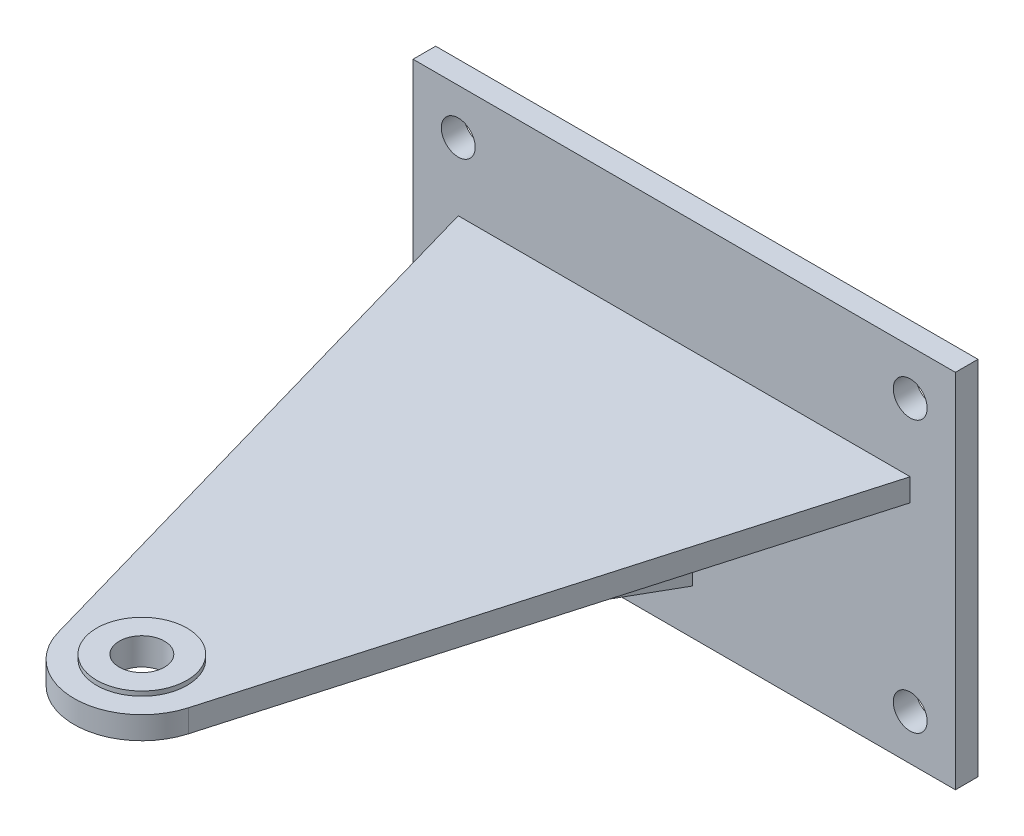
ISO-10303-21;
HEADER;
FILE_DESCRIPTION(('STEP AP214'),'2;1');
FILE_NAME('part.step','',(''),(''),'','','');
FILE_SCHEMA(('AUTOMOTIVE_DESIGN { 1 0 10303 214 1 1 1 1 }'));
ENDSEC;
DATA;
#1=APPLICATION_CONTEXT('core data for automotive mechanical design processes');
#2=APPLICATION_PROTOCOL_DEFINITION('international standard','automotive_design',2000,#1);
#3=PRODUCT_CONTEXT('',#1,'mechanical');
#4=PRODUCT('Part','Part','',(#3));
#5=PRODUCT_RELATED_PRODUCT_CATEGORY('part','',(#4));
#6=PRODUCT_DEFINITION_FORMATION('','',#4);
#7=PRODUCT_DEFINITION_CONTEXT('part definition',#1,'design');
#8=PRODUCT_DEFINITION('design','',#6,#7);
#9=PRODUCT_DEFINITION_SHAPE('','',#8);
#10=(LENGTH_UNIT() NAMED_UNIT(*) SI_UNIT(.MILLI.,.METRE.));
#11=(NAMED_UNIT(*) PLANE_ANGLE_UNIT() SI_UNIT($,.RADIAN.));
#12=(NAMED_UNIT(*) SI_UNIT($,.STERADIAN.) SOLID_ANGLE_UNIT());
#13=UNCERTAINTY_MEASURE_WITH_UNIT(LENGTH_MEASURE(1.E-05),#10,'distance_accuracy_value','');
#14=(GEOMETRIC_REPRESENTATION_CONTEXT(3) GLOBAL_UNCERTAINTY_ASSIGNED_CONTEXT((#13)) GLOBAL_UNIT_ASSIGNED_CONTEXT((#10,
#11,#12)) REPRESENTATION_CONTEXT('',''));
#15=CARTESIAN_POINT('',(0.,0.,0.));
#16=DIRECTION('',(0.,0.,1.));
#17=DIRECTION('',(1.,0.,0.));
#18=AXIS2_PLACEMENT_3D('',#15,#16,#17);
#19=CARTESIAN_POINT('',(0.,0.,6.35));
#20=DIRECTION('',(0.,0.,1.));
#21=DIRECTION('',(1.,0.,0.));
#22=AXIS2_PLACEMENT_3D('',#19,#20,#21);
#23=PLANE('',#22);
#24=CARTESIAN_POINT('',(-63.5,-38.1,6.35));
#25=DIRECTION('',(0.,0.,1.));
#26=DIRECTION('',(1.,0.,0.));
#27=AXIS2_PLACEMENT_3D('',#24,#25,#26);
#28=CIRCLE('',#27,4.7625);
#29=CARTESIAN_POINT('',(-58.7375,-38.1,6.35));
#30=VERTEX_POINT('',#29);
#31=EDGE_CURVE('E499',#30,#30,#28,.T.);
#32=ORIENTED_EDGE('',*,*,#31,.F.);
#33=EDGE_LOOP('',(#32));
#34=FACE_BOUND('',#33,.T.);
#35=CARTESIAN_POINT('',(63.5,38.1,6.35));
#36=DIRECTION('',(0.,0.,1.));
#37=DIRECTION('',(1.,0.,0.));
#38=AXIS2_PLACEMENT_3D('',#35,#36,#37);
#39=CIRCLE('',#38,4.7625);
#40=CARTESIAN_POINT('',(68.2625,38.1,6.35));
#41=VERTEX_POINT('',#40);
#42=EDGE_CURVE('E501',#41,#41,#39,.T.);
#43=ORIENTED_EDGE('',*,*,#42,.F.);
#44=EDGE_LOOP('',(#43));
#45=FACE_BOUND('',#44,.T.);
#46=CARTESIAN_POINT('',(63.5,-38.1,6.35));
#47=DIRECTION('',(0.,0.,1.));
#48=DIRECTION('',(1.,0.,0.));
#49=AXIS2_PLACEMENT_3D('',#46,#47,#48);
#50=CIRCLE('',#49,4.7625);
#51=CARTESIAN_POINT('',(68.2625,-38.1,6.35));
#52=VERTEX_POINT('',#51);
#53=EDGE_CURVE('E504',#52,#52,#50,.T.);
#54=ORIENTED_EDGE('',*,*,#53,.F.);
#55=EDGE_LOOP('',(#54));
#56=FACE_BOUND('',#55,.T.);
#57=CARTESIAN_POINT('',(-63.5,38.1,6.35));
#58=DIRECTION('',(0.,0.,1.));
#59=DIRECTION('',(1.,0.,0.));
#60=AXIS2_PLACEMENT_3D('',#57,#58,#59);
#61=CIRCLE('',#60,4.7625);
#62=CARTESIAN_POINT('',(-58.7375,38.1,6.35));
#63=VERTEX_POINT('',#62);
#64=EDGE_CURVE('E493',#63,#63,#61,.T.);
#65=ORIENTED_EDGE('',*,*,#64,.F.);
#66=EDGE_LOOP('',(#65));
#67=FACE_BOUND('',#66,.T.);
#68=DIRECTION('',(0.,1.,0.));
#69=VECTOR('',#68,1.);
#70=CARTESIAN_POINT('',(-63.5,12.7,6.35));
#71=LINE('',#70,#69);
#72=CARTESIAN_POINT('',(-63.5,12.7,6.35));
#73=VERTEX_POINT('',#72);
#74=CARTESIAN_POINT('',(-63.5,19.05,6.35));
#75=VERTEX_POINT('',#74);
#76=EDGE_CURVE('E238',#73,#75,#71,.T.);
#77=ORIENTED_EDGE('',*,*,#76,.T.);
#78=DIRECTION('',(-1.,0.,0.));
#79=VECTOR('',#78,1.);
#80=CARTESIAN_POINT('',(-63.5,19.05,6.35));
#81=LINE('',#80,#79);
#82=CARTESIAN_POINT('',(63.5,19.05,6.35));
#83=VERTEX_POINT('',#82);
#84=EDGE_CURVE('E222',#83,#75,#81,.T.);
#85=ORIENTED_EDGE('',*,*,#84,.F.);
#86=DIRECTION('',(0.,1.,0.));
#87=VECTOR('',#86,1.);
#88=CARTESIAN_POINT('',(63.5,12.7,6.34999999999998));
#89=LINE('',#88,#87);
#90=CARTESIAN_POINT('',(63.5,12.7,6.34999999999998));
#91=VERTEX_POINT('',#90);
#92=EDGE_CURVE('E248',#91,#83,#89,.T.);
#93=ORIENTED_EDGE('',*,*,#92,.F.);
#94=DIRECTION('',(-1.,0.,0.));
#95=VECTOR('',#94,1.);
#96=CARTESIAN_POINT('',(-63.5,12.7,6.35));
#97=LINE('',#96,#95);
#98=CARTESIAN_POINT('',(26.67,12.7,6.34999999999999));
#99=VERTEX_POINT('',#98);
#100=EDGE_CURVE('E223',#91,#99,#97,.T.);
#101=ORIENTED_EDGE('',*,*,#100,.T.);
#102=DIRECTION('',(0.,1.,0.));
#103=VECTOR('',#102,1.);
#104=CARTESIAN_POINT('',(26.67,0.,6.35));
#105=LINE('',#104,#103);
#106=CARTESIAN_POINT('',(26.67,-12.7,6.35));
#107=VERTEX_POINT('',#106);
#108=EDGE_CURVE('E190',#107,#99,#105,.T.);
#109=ORIENTED_EDGE('',*,*,#108,.F.);
#110=DIRECTION('',(1.,0.,0.));
#111=VECTOR('',#110,1.);
#112=CARTESIAN_POINT('',(0.,-12.7,6.35));
#113=LINE('',#112,#111);
#114=CARTESIAN_POINT('',(24.13,-12.7,6.35));
#115=VERTEX_POINT('',#114);
#116=EDGE_CURVE('E195',#115,#107,#113,.T.);
#117=ORIENTED_EDGE('',*,*,#116,.F.);
#118=DIRECTION('',(0.,1.,0.));
#119=VECTOR('',#118,1.);
#120=CARTESIAN_POINT('',(24.13,0.,6.35));
#121=LINE('',#120,#119);
#122=CARTESIAN_POINT('',(24.13,12.7,6.34999999999999));
#123=VERTEX_POINT('',#122);
#124=EDGE_CURVE('E184',#115,#123,#121,.T.);
#125=ORIENTED_EDGE('',*,*,#124,.T.);
#126=CARTESIAN_POINT('',(2.38125,12.7,6.34999999999999));
#127=VERTEX_POINT('',#126);
#128=EDGE_CURVE('E227',#123,#127,#97,.T.);
#129=ORIENTED_EDGE('',*,*,#128,.T.);
#130=DIRECTION('',(0.,1.,0.));
#131=VECTOR('',#130,1.);
#132=CARTESIAN_POINT('',(2.38125,12.7,6.34999999999998));
#133=LINE('',#132,#131);
#134=CARTESIAN_POINT('',(2.38125,-38.1,6.35));
#135=VERTEX_POINT('',#134);
#136=EDGE_CURVE('E198',#135,#127,#133,.T.);
#137=ORIENTED_EDGE('',*,*,#136,.F.);
#138=DIRECTION('',(-1.,0.,0.));
#139=VECTOR('',#138,1.);
#140=CARTESIAN_POINT('',(2.38125,-38.1,6.35));
#141=LINE('',#140,#139);
#142=CARTESIAN_POINT('',(-2.38125,-38.1,6.35));
#143=VERTEX_POINT('',#142);
#144=EDGE_CURVE('E208',#135,#143,#141,.T.);
#145=ORIENTED_EDGE('',*,*,#144,.T.);
#146=DIRECTION('',(0.,1.,0.));
#147=VECTOR('',#146,1.);
#148=CARTESIAN_POINT('',(-2.38125,12.7,6.34999999999998));
#149=LINE('',#148,#147);
#150=CARTESIAN_POINT('',(-2.38125,12.7,6.34999999999998));
#151=VERTEX_POINT('',#150);
#152=EDGE_CURVE('E197',#143,#151,#149,.T.);
#153=ORIENTED_EDGE('',*,*,#152,.T.);
#154=CARTESIAN_POINT('',(-24.13,12.7,6.34999999999999));
#155=VERTEX_POINT('',#154);
#156=EDGE_CURVE('E229',#151,#155,#97,.T.);
#157=ORIENTED_EDGE('',*,*,#156,.T.);
#158=DIRECTION('',(0.,-1.,0.));
#159=VECTOR('',#158,1.);
#160=CARTESIAN_POINT('',(-24.13,0.,6.35));
#161=LINE('',#160,#159);
#162=CARTESIAN_POINT('',(-24.13,-12.7,6.35));
#163=VERTEX_POINT('',#162);
#164=EDGE_CURVE('E49',#155,#163,#161,.T.);
#165=ORIENTED_EDGE('',*,*,#164,.T.);
#166=DIRECTION('',(-1.,0.,0.));
#167=VECTOR('',#166,1.);
#168=CARTESIAN_POINT('',(0.,-12.7,6.35));
#169=LINE('',#168,#167);
#170=CARTESIAN_POINT('',(-26.67,-12.7,6.35));
#171=VERTEX_POINT('',#170);
#172=EDGE_CURVE('E166',#171,#163,#169,.F.);
#173=ORIENTED_EDGE('',*,*,#172,.F.);
#174=DIRECTION('',(0.,-1.,0.));
#175=VECTOR('',#174,1.);
#176=CARTESIAN_POINT('',(-26.67,0.,6.35));
#177=LINE('',#176,#175);
#178=CARTESIAN_POINT('',(-26.67,12.7,6.34999999999999));
#179=VERTEX_POINT('',#178);
#180=EDGE_CURVE('E173',#179,#171,#177,.T.);
#181=ORIENTED_EDGE('',*,*,#180,.F.);
#182=EDGE_CURVE('E228',#179,#73,#97,.T.);
#183=ORIENTED_EDGE('',*,*,#182,.T.);
#184=EDGE_LOOP('',(#77,#85,#93,#101,#109,#117,#125,#129,#137,#145,#153,#157,#165,#173,#181,#183));
#185=FACE_BOUND('',#184,.T.);
#186=DIRECTION('',(-1.,0.,0.));
#187=VECTOR('',#186,1.);
#188=CARTESIAN_POINT('',(76.2,50.8,6.35));
#189=LINE('',#188,#187);
#190=CARTESIAN_POINT('',(76.2,50.8,6.35));
#191=VERTEX_POINT('',#190);
#192=CARTESIAN_POINT('',(-76.2,50.8,6.35));
#193=VERTEX_POINT('',#192);
#194=EDGE_CURVE('E266',#191,#193,#189,.T.);
#195=ORIENTED_EDGE('',*,*,#194,.T.);
#196=DIRECTION('',(0.,-1.,0.));
#197=VECTOR('',#196,1.);
#198=CARTESIAN_POINT('',(-76.2,-50.8,6.35));
#199=LINE('',#198,#197);
#200=CARTESIAN_POINT('',(-76.2,-50.8,6.35));
#201=VERTEX_POINT('',#200);
#202=EDGE_CURVE('E258',#193,#201,#199,.T.);
#203=ORIENTED_EDGE('',*,*,#202,.T.);
#204=DIRECTION('',(1.,0.,0.));
#205=VECTOR('',#204,1.);
#206=CARTESIAN_POINT('',(76.2,-50.8,6.35));
#207=LINE('',#206,#205);
#208=CARTESIAN_POINT('',(76.2,-50.8,6.35));
#209=VERTEX_POINT('',#208);
#210=EDGE_CURVE('E261',#201,#209,#207,.T.);
#211=ORIENTED_EDGE('',*,*,#210,.T.);
#212=DIRECTION('',(0.,1.,0.));
#213=VECTOR('',#212,1.);
#214=CARTESIAN_POINT('',(76.2,-50.8,6.35));
#215=LINE('',#214,#213);
#216=EDGE_CURVE('E264',#209,#191,#215,.T.);
#217=ORIENTED_EDGE('',*,*,#216,.T.);
#218=EDGE_LOOP('',(#195,#203,#211,#217));
#219=FACE_BOUND('',#218,.T.);
#220=ADVANCED_FACE('F34',(#34,#45,#56,#67,#185,#219),#23,.T.);
#221=CARTESIAN_POINT('',(0.,12.7,158.75));
#222=DIRECTION('',(0.,-1.,0.));
#223=DIRECTION('',(1.,0.,0.));
#224=AXIS2_PLACEMENT_3D('',#221,#222,#223);
#225=PLANE('',#224);
#226=CARTESIAN_POINT('',(0.,12.7,158.75));
#227=DIRECTION('',(0.,-1.,0.));
#228=DIRECTION('',(1.,0.,0.));
#229=AXIS2_PLACEMENT_3D('',#226,#227,#228);
#230=CIRCLE('',#229,6.35);
#231=CARTESIAN_POINT('',(6.35000000000002,12.7,158.75));
#232=VERTEX_POINT('',#231);
#233=EDGE_CURVE('E167',#232,#232,#230,.T.);
#234=ORIENTED_EDGE('',*,*,#233,.F.);
#235=EDGE_LOOP('',(#234));
#236=FACE_BOUND('',#235,.T.);
#237=DIRECTION('',(0.,0.,-1.));
#238=VECTOR('',#237,1.);
#239=CARTESIAN_POINT('',(-26.67,12.7,158.75));
#240=LINE('',#239,#238);
#241=CARTESIAN_POINT('',(-26.67,12.7,57.15));
#242=VERTEX_POINT('',#241);
#243=EDGE_CURVE('E172',#242,#179,#240,.T.);
#244=ORIENTED_EDGE('',*,*,#243,.F.);
#245=DIRECTION('',(1.,0.,0.));
#246=VECTOR('',#245,1.);
#247=CARTESIAN_POINT('',(0.,12.7,57.15));
#248=LINE('',#247,#246);
#249=CARTESIAN_POINT('',(-24.13,12.7,57.15));
#250=VERTEX_POINT('',#249);
#251=EDGE_CURVE('E163',#250,#242,#248,.F.);
#252=ORIENTED_EDGE('',*,*,#251,.F.);
#253=DIRECTION('',(0.,0.,-1.));
#254=VECTOR('',#253,1.);
#255=CARTESIAN_POINT('',(-24.13,12.7,158.75));
#256=LINE('',#255,#254);
#257=EDGE_CURVE('E151',#250,#155,#256,.T.);
#258=ORIENTED_EDGE('',*,*,#257,.T.);
#259=ORIENTED_EDGE('',*,*,#156,.F.);
#260=DIRECTION('',(0.,0.,1.));
#261=VECTOR('',#260,1.);
#262=CARTESIAN_POINT('',(-2.38125,12.7,6.34999999999998));
#263=LINE('',#262,#261);
#264=CARTESIAN_POINT('',(-2.38125,12.7,146.05));
#265=VERTEX_POINT('',#264);
#266=EDGE_CURVE('E211',#151,#265,#263,.T.);
#267=ORIENTED_EDGE('',*,*,#266,.T.);
#268=DIRECTION('',(-1.,0.,0.));
#269=VECTOR('',#268,1.);
#270=CARTESIAN_POINT('',(2.38125,12.7,146.05));
#271=LINE('',#270,#269);
#272=CARTESIAN_POINT('',(2.38125,12.7,146.05));
#273=VERTEX_POINT('',#272);
#274=EDGE_CURVE('E216',#273,#265,#271,.T.);
#275=ORIENTED_EDGE('',*,*,#274,.F.);
#276=DIRECTION('',(0.,0.,1.));
#277=VECTOR('',#276,1.);
#278=CARTESIAN_POINT('',(2.38125,12.7,6.34999999999998));
#279=LINE('',#278,#277);
#280=EDGE_CURVE('E201',#127,#273,#279,.T.);
#281=ORIENTED_EDGE('',*,*,#280,.F.);
#282=ORIENTED_EDGE('',*,*,#128,.F.);
#283=DIRECTION('',(0.,0.,1.));
#284=VECTOR('',#283,1.);
#285=CARTESIAN_POINT('',(24.13,12.7,158.75));
#286=LINE('',#285,#284);
#287=CARTESIAN_POINT('',(24.13,12.7,57.15));
#288=VERTEX_POINT('',#287);
#289=EDGE_CURVE('E182',#123,#288,#286,.T.);
#290=ORIENTED_EDGE('',*,*,#289,.T.);
#291=DIRECTION('',(-1.,0.,0.));
#292=VECTOR('',#291,1.);
#293=CARTESIAN_POINT('',(0.,12.7,57.15));
#294=LINE('',#293,#292);
#295=CARTESIAN_POINT('',(26.67,12.7,57.15));
#296=VERTEX_POINT('',#295);
#297=EDGE_CURVE('E192',#296,#288,#294,.T.);
#298=ORIENTED_EDGE('',*,*,#297,.F.);
#299=DIRECTION('',(0.,0.,1.));
#300=VECTOR('',#299,1.);
#301=CARTESIAN_POINT('',(26.67,12.7,158.75));
#302=LINE('',#301,#300);
#303=EDGE_CURVE('E187',#99,#296,#302,.T.);
#304=ORIENTED_EDGE('',*,*,#303,.F.);
#305=ORIENTED_EDGE('',*,*,#100,.F.);
#306=DIRECTION('',(0.27553762041849,0.,-0.961290289004376));
#307=VECTOR('',#306,1.);
#308=CARTESIAN_POINT('',(63.5,12.7,6.34999999999998));
#309=LINE('',#308,#307);
#310=CARTESIAN_POINT('',(18.3125800055333,12.7,163.998991668972));
#311=VERTEX_POINT('',#310);
#312=EDGE_CURVE('E235',#311,#91,#309,.T.);
#313=ORIENTED_EDGE('',*,*,#312,.F.);
#314=CARTESIAN_POINT('',(0.,12.7,158.75));
#315=DIRECTION('',(0.,1.,0.));
#316=DIRECTION('',(1.,0.,0.));
#317=AXIS2_PLACEMENT_3D('',#314,#315,#316);
#318=CIRCLE('',#317,19.05);
#319=CARTESIAN_POINT('',(-18.3125800055333,12.7,163.998991668972));
#320=VERTEX_POINT('',#319);
#321=EDGE_CURVE('E232',#320,#311,#318,.T.);
#322=ORIENTED_EDGE('',*,*,#321,.F.);
#323=DIRECTION('',(0.27553762041849,0.,0.961290289004376));
#324=VECTOR('',#323,1.);
#325=CARTESIAN_POINT('',(-63.5,12.7,6.35));
#326=LINE('',#325,#324);
#327=EDGE_CURVE('E226',#73,#320,#326,.T.);
#328=ORIENTED_EDGE('',*,*,#327,.F.);
#329=ORIENTED_EDGE('',*,*,#182,.F.);
#330=EDGE_LOOP('',(#244,#252,#258,#259,#267,#275,#281,#282,#290,#298,#304,#305,#313,#322,#328,#329));
#331=FACE_BOUND('',#330,.T.);
#332=ADVANCED_FACE('F170',(#236,#331),#225,.T.);
#333=CARTESIAN_POINT('',(-76.2,-50.8,6.35));
#334=DIRECTION('',(1.,0.,0.));
#335=DIRECTION('',(0.,0.,-1.));
#336=AXIS2_PLACEMENT_3D('',#333,#334,#335);
#337=PLANE('',#336);
#338=DIRECTION('',(0.,-1.,0.));
#339=VECTOR('',#338,1.);
#340=CARTESIAN_POINT('',(-76.2,-50.8,0.));
#341=LINE('',#340,#339);
#342=CARTESIAN_POINT('',(-76.2,50.8,0.));
#343=VERTEX_POINT('',#342);
#344=CARTESIAN_POINT('',(-76.2,-50.8,0.));
#345=VERTEX_POINT('',#344);
#346=EDGE_CURVE('E251',#343,#345,#341,.T.);
#347=ORIENTED_EDGE('',*,*,#346,.T.);
#348=DIRECTION('',(0.,0.,-1.));
#349=VECTOR('',#348,1.);
#350=CARTESIAN_POINT('',(-76.2,-50.8,6.35));
#351=LINE('',#350,#349);
#352=EDGE_CURVE('E42',#201,#345,#351,.T.);
#353=ORIENTED_EDGE('',*,*,#352,.F.);
#354=ORIENTED_EDGE('',*,*,#202,.F.);
#355=DIRECTION('',(0.,0.,-1.));
#356=VECTOR('',#355,1.);
#357=CARTESIAN_POINT('',(-76.2,50.8,6.35));
#358=LINE('',#357,#356);
#359=EDGE_CURVE('E268',#193,#343,#358,.T.);
#360=ORIENTED_EDGE('',*,*,#359,.T.);
#361=EDGE_LOOP('',(#347,#353,#354,#360));
#362=FACE_BOUND('',#361,.T.);
#363=ADVANCED_FACE('F36',(#362),#337,.F.);
#364=CARTESIAN_POINT('',(76.2,-50.8,6.35));
#365=DIRECTION('',(0.,1.,0.));
#366=DIRECTION('',(-1.,0.,0.));
#367=AXIS2_PLACEMENT_3D('',#364,#365,#366);
#368=PLANE('',#367);
#369=DIRECTION('',(1.,0.,0.));
#370=VECTOR('',#369,1.);
#371=CARTESIAN_POINT('',(76.2,-50.8,0.));
#372=LINE('',#371,#370);
#373=CARTESIAN_POINT('',(76.2,-50.8,0.));
#374=VERTEX_POINT('',#373);
#375=EDGE_CURVE('E271',#345,#374,#372,.T.);
#376=ORIENTED_EDGE('',*,*,#375,.T.);
#377=DIRECTION('',(0.,0.,-1.));
#378=VECTOR('',#377,1.);
#379=CARTESIAN_POINT('',(76.2,-50.8,6.35));
#380=LINE('',#379,#378);
#381=EDGE_CURVE('E281',#209,#374,#380,.T.);
#382=ORIENTED_EDGE('',*,*,#381,.F.);
#383=ORIENTED_EDGE('',*,*,#210,.F.);
#384=ORIENTED_EDGE('',*,*,#352,.T.);
#385=EDGE_LOOP('',(#376,#382,#383,#384));
#386=FACE_BOUND('',#385,.T.);
#387=ADVANCED_FACE('F286',(#386),#368,.F.);
#388=CARTESIAN_POINT('',(76.2,-50.8,6.35));
#389=DIRECTION('',(-1.,0.,0.));
#390=DIRECTION('',(0.,0.,1.));
#391=AXIS2_PLACEMENT_3D('',#388,#389,#390);
#392=PLANE('',#391);
#393=DIRECTION('',(0.,1.,0.));
#394=VECTOR('',#393,1.);
#395=CARTESIAN_POINT('',(76.2,-50.8,0.));
#396=LINE('',#395,#394);
#397=CARTESIAN_POINT('',(76.2,50.8,0.));
#398=VERTEX_POINT('',#397);
#399=EDGE_CURVE('E273',#374,#398,#396,.T.);
#400=ORIENTED_EDGE('',*,*,#399,.T.);
#401=DIRECTION('',(0.,0.,-1.));
#402=VECTOR('',#401,1.);
#403=CARTESIAN_POINT('',(76.2,50.8,6.35));
#404=LINE('',#403,#402);
#405=EDGE_CURVE('E278',#191,#398,#404,.T.);
#406=ORIENTED_EDGE('',*,*,#405,.F.);
#407=ORIENTED_EDGE('',*,*,#216,.F.);
#408=ORIENTED_EDGE('',*,*,#381,.T.);
#409=EDGE_LOOP('',(#400,#406,#407,#408));
#410=FACE_BOUND('',#409,.T.);
#411=ADVANCED_FACE('F298',(#410),#392,.F.);
#412=CARTESIAN_POINT('',(76.2,50.8,6.35));
#413=DIRECTION('',(0.,-1.,0.));
#414=DIRECTION('',(1.,0.,0.));
#415=AXIS2_PLACEMENT_3D('',#412,#413,#414);
#416=PLANE('',#415);
#417=ORIENTED_EDGE('',*,*,#359,.F.);
#418=ORIENTED_EDGE('',*,*,#194,.F.);
#419=ORIENTED_EDGE('',*,*,#405,.T.);
#420=DIRECTION('',(-1.,0.,0.));
#421=VECTOR('',#420,1.);
#422=CARTESIAN_POINT('',(76.2,50.8,0.));
#423=LINE('',#422,#421);
#424=EDGE_CURVE('E262',#398,#343,#423,.T.);
#425=ORIENTED_EDGE('',*,*,#424,.T.);
#426=EDGE_LOOP('',(#417,#418,#419,#425));
#427=FACE_BOUND('',#426,.T.);
#428=ADVANCED_FACE('F302',(#427),#416,.F.);
#429=CARTESIAN_POINT('',(0.,0.,0.));
#430=DIRECTION('',(0.,0.,1.));
#431=DIRECTION('',(1.,0.,0.));
#432=AXIS2_PLACEMENT_3D('',#429,#430,#431);
#433=PLANE('',#432);
#434=CARTESIAN_POINT('',(-63.5,-38.1,0.));
#435=DIRECTION('',(0.,0.,1.));
#436=DIRECTION('',(1.,0.,0.));
#437=AXIS2_PLACEMENT_3D('',#434,#435,#436);
#438=CIRCLE('',#437,4.7625);
#439=CARTESIAN_POINT('',(-58.7375,-38.1,0.));
#440=VERTEX_POINT('',#439);
#441=EDGE_CURVE('E507',#440,#440,#438,.T.);
#442=ORIENTED_EDGE('',*,*,#441,.T.);
#443=EDGE_LOOP('',(#442));
#444=FACE_BOUND('',#443,.T.);
#445=CARTESIAN_POINT('',(63.5,38.1,0.));
#446=DIRECTION('',(0.,0.,1.));
#447=DIRECTION('',(1.,0.,0.));
#448=AXIS2_PLACEMENT_3D('',#445,#446,#447);
#449=CIRCLE('',#448,4.7625);
#450=CARTESIAN_POINT('',(68.2625,38.1,0.));
#451=VERTEX_POINT('',#450);
#452=EDGE_CURVE('E511',#451,#451,#449,.T.);
#453=ORIENTED_EDGE('',*,*,#452,.T.);
#454=EDGE_LOOP('',(#453));
#455=FACE_BOUND('',#454,.T.);
#456=CARTESIAN_POINT('',(63.5,-38.1,0.));
#457=DIRECTION('',(0.,0.,1.));
#458=DIRECTION('',(1.,0.,0.));
#459=AXIS2_PLACEMENT_3D('',#456,#457,#458);
#460=CIRCLE('',#459,4.7625);
#461=CARTESIAN_POINT('',(68.2625,-38.1,0.));
#462=VERTEX_POINT('',#461);
#463=EDGE_CURVE('E508',#462,#462,#460,.T.);
#464=ORIENTED_EDGE('',*,*,#463,.T.);
#465=EDGE_LOOP('',(#464));
#466=FACE_BOUND('',#465,.T.);
#467=CARTESIAN_POINT('',(-63.5,38.1,0.));
#468=DIRECTION('',(0.,0.,1.));
#469=DIRECTION('',(1.,0.,0.));
#470=AXIS2_PLACEMENT_3D('',#467,#468,#469);
#471=CIRCLE('',#470,4.7625);
#472=CARTESIAN_POINT('',(-58.7375,38.1,0.));
#473=VERTEX_POINT('',#472);
#474=EDGE_CURVE('E496',#473,#473,#471,.T.);
#475=ORIENTED_EDGE('',*,*,#474,.T.);
#476=EDGE_LOOP('',(#475));
#477=FACE_BOUND('',#476,.T.);
#478=ORIENTED_EDGE('',*,*,#346,.F.);
#479=ORIENTED_EDGE('',*,*,#424,.F.);
#480=ORIENTED_EDGE('',*,*,#399,.F.);
#481=ORIENTED_EDGE('',*,*,#375,.F.);
#482=EDGE_LOOP('',(#478,#479,#480,#481));
#483=FACE_BOUND('',#482,.T.);
#484=ADVANCED_FACE('F294',(#444,#455,#466,#477,#483),#433,.F.);
#485=CARTESIAN_POINT('',(63.5,12.7,6.34999999999998));
#486=DIRECTION('',(0.961290289004376,0.,0.27553762041849));
#487=DIRECTION('',(0.27553762041849,0.,-0.961290289004376));
#488=AXIS2_PLACEMENT_3D('',#485,#486,#487);
#489=PLANE('',#488);
#490=DIRECTION('',(0.27553762041849,0.,-0.961290289004376));
#491=VECTOR('',#490,1.);
#492=CARTESIAN_POINT('',(63.5,19.05,6.34999999999998));
#493=LINE('',#492,#491);
#494=CARTESIAN_POINT('',(18.3125800055333,19.05,163.998991668972));
#495=VERTEX_POINT('',#494);
#496=EDGE_CURVE('E246',#495,#83,#493,.T.);
#497=ORIENTED_EDGE('',*,*,#496,.F.);
#498=DIRECTION('',(0.,1.,0.));
#499=VECTOR('',#498,1.);
#500=CARTESIAN_POINT('',(18.3125800055333,12.7,163.998991668972));
#501=LINE('',#500,#499);
#502=EDGE_CURVE('E252',#311,#495,#501,.T.);
#503=ORIENTED_EDGE('',*,*,#502,.F.);
#504=ORIENTED_EDGE('',*,*,#312,.T.);
#505=ORIENTED_EDGE('',*,*,#92,.T.);
#506=EDGE_LOOP('',(#497,#503,#504,#505));
#507=FACE_BOUND('',#506,.T.);
#508=ADVANCED_FACE('F320',(#507),#489,.T.);
#509=CARTESIAN_POINT('',(0.,12.7,158.75));
#510=DIRECTION('',(0.,1.,0.));
#511=DIRECTION('',(-1.,0.,0.));
#512=AXIS2_PLACEMENT_3D('',#509,#510,#511);
#513=CYLINDRICAL_SURFACE('',#512,19.05);
#514=CARTESIAN_POINT('',(0.,19.05,158.75));
#515=DIRECTION('',(0.,1.,0.));
#516=DIRECTION('',(1.,0.,0.));
#517=AXIS2_PLACEMENT_3D('',#514,#515,#516);
#518=CIRCLE('',#517,19.05);
#519=CARTESIAN_POINT('',(-18.3125800055333,19.05,163.998991668972));
#520=VERTEX_POINT('',#519);
#521=EDGE_CURVE('E243',#520,#495,#518,.T.);
#522=ORIENTED_EDGE('',*,*,#521,.F.);
#523=DIRECTION('',(0.,1.,0.));
#524=VECTOR('',#523,1.);
#525=CARTESIAN_POINT('',(-18.3125800055333,12.7,163.998991668972));
#526=LINE('',#525,#524);
#527=EDGE_CURVE('E254',#320,#520,#526,.T.);
#528=ORIENTED_EDGE('',*,*,#527,.F.);
#529=ORIENTED_EDGE('',*,*,#321,.T.);
#530=ORIENTED_EDGE('',*,*,#502,.T.);
#531=EDGE_LOOP('',(#522,#528,#529,#530));
#532=FACE_BOUND('',#531,.T.);
#533=ADVANCED_FACE('F458',(#532),#513,.T.);
#534=CARTESIAN_POINT('',(-63.5,12.7,6.35));
#535=DIRECTION('',(-0.961290289004376,0.,0.27553762041849));
#536=DIRECTION('',(0.27553762041849,0.,0.961290289004376));
#537=AXIS2_PLACEMENT_3D('',#534,#535,#536);
#538=PLANE('',#537);
#539=DIRECTION('',(0.27553762041849,0.,0.961290289004376));
#540=VECTOR('',#539,1.);
#541=CARTESIAN_POINT('',(-63.5,19.05,6.35));
#542=LINE('',#541,#540);
#543=EDGE_CURVE('E240',#75,#520,#542,.T.);
#544=ORIENTED_EDGE('',*,*,#543,.F.);
#545=ORIENTED_EDGE('',*,*,#76,.F.);
#546=ORIENTED_EDGE('',*,*,#327,.T.);
#547=ORIENTED_EDGE('',*,*,#527,.T.);
#548=EDGE_LOOP('',(#544,#545,#546,#547));
#549=FACE_BOUND('',#548,.T.);
#550=ADVANCED_FACE('F316',(#549),#538,.T.);
#551=CARTESIAN_POINT('',(0.,19.05,158.75));
#552=DIRECTION('',(0.,-1.,0.));
#553=DIRECTION('',(1.,0.,0.));
#554=AXIS2_PLACEMENT_3D('',#551,#552,#553);
#555=PLANE('',#554);
#556=ORIENTED_EDGE('',*,*,#84,.T.);
#557=ORIENTED_EDGE('',*,*,#543,.T.);
#558=ORIENTED_EDGE('',*,*,#521,.T.);
#559=ORIENTED_EDGE('',*,*,#496,.T.);
#560=EDGE_LOOP('',(#556,#557,#558,#559));
#561=FACE_BOUND('',#560,.T.);
#562=CARTESIAN_POINT('',(0.,19.05,158.75));
#563=DIRECTION('',(0.,-1.,0.));
#564=DIRECTION('',(1.,0.,0.));
#565=AXIS2_PLACEMENT_3D('',#562,#563,#564);
#566=CIRCLE('',#565,12.7);
#567=CARTESIAN_POINT('',(12.7,19.05,158.75));
#568=VERTEX_POINT('',#567);
#569=EDGE_CURVE('E11',#568,#568,#566,.F.);
#570=ORIENTED_EDGE('',*,*,#569,.F.);
#571=EDGE_LOOP('',(#570));
#572=FACE_BOUND('',#571,.T.);
#573=ADVANCED_FACE('F452',(#561,#572),#555,.F.);
#574=CARTESIAN_POINT('',(0.,20.32,158.75));
#575=DIRECTION('',(0.,-1.,0.));
#576=DIRECTION('',(1.,0.,0.));
#577=AXIS2_PLACEMENT_3D('',#574,#575,#576);
#578=CYLINDRICAL_SURFACE('',#577,12.7);
#579=CARTESIAN_POINT('',(0.,20.32,158.75));
#580=DIRECTION('',(0.,1.,0.));
#581=DIRECTION('',(-1.,0.,0.));
#582=AXIS2_PLACEMENT_3D('',#579,#580,#581);
#583=CIRCLE('',#582,12.7);
#584=CARTESIAN_POINT('',(-12.7,20.32,158.75));
#585=VERTEX_POINT('',#584);
#586=EDGE_CURVE('E219',#585,#585,#583,.T.);
#587=ORIENTED_EDGE('',*,*,#586,.F.);
#588=EDGE_LOOP('',(#587));
#589=FACE_BOUND('',#588,.T.);
#590=ORIENTED_EDGE('',*,*,#569,.T.);
#591=EDGE_LOOP('',(#590));
#592=FACE_BOUND('',#591,.T.);
#593=ADVANCED_FACE('F352',(#589,#592),#578,.T.);
#594=CARTESIAN_POINT('',(0.,20.32,158.75));
#595=DIRECTION('',(0.,1.,0.));
#596=DIRECTION('',(-1.,0.,0.));
#597=AXIS2_PLACEMENT_3D('',#594,#595,#596);
#598=PLANE('',#597);
#599=CARTESIAN_POINT('',(0.,20.32,158.75));
#600=DIRECTION('',(0.,1.,0.));
#601=DIRECTION('',(-1.,0.,0.));
#602=AXIS2_PLACEMENT_3D('',#599,#600,#601);
#603=CIRCLE('',#602,6.35);
#604=CARTESIAN_POINT('',(-6.34999999999998,20.32,158.75));
#605=VERTEX_POINT('',#604);
#606=EDGE_CURVE('E490',#605,#605,#603,.T.);
#607=ORIENTED_EDGE('',*,*,#606,.F.);
#608=EDGE_LOOP('',(#607));
#609=FACE_BOUND('',#608,.T.);
#610=ORIENTED_EDGE('',*,*,#586,.T.);
#611=EDGE_LOOP('',(#610));
#612=FACE_BOUND('',#611,.T.);
#613=ADVANCED_FACE('F347',(#609,#612),#598,.T.);
#614=CARTESIAN_POINT('',(2.38125,-38.1,6.35));
#615=DIRECTION('',(0.,0.939793423488437,-0.341743063086704));
#616=DIRECTION('',(0.,0.341743063086704,0.939793423488437));
#617=AXIS2_PLACEMENT_3D('',#614,#615,#616);
#618=PLANE('',#617);
#619=DIRECTION('',(0.,-0.341743063086704,-0.939793423488437));
#620=VECTOR('',#619,1.);
#621=CARTESIAN_POINT('',(-2.38125,-38.1,6.35));
#622=LINE('',#621,#620);
#623=EDGE_CURVE('E202',#265,#143,#622,.T.);
#624=ORIENTED_EDGE('',*,*,#623,.T.);
#625=ORIENTED_EDGE('',*,*,#144,.F.);
#626=DIRECTION('',(0.,-0.341743063086704,-0.939793423488437));
#627=VECTOR('',#626,1.);
#628=CARTESIAN_POINT('',(2.38125,-38.1,6.35));
#629=LINE('',#628,#627);
#630=EDGE_CURVE('E205',#273,#135,#629,.T.);
#631=ORIENTED_EDGE('',*,*,#630,.F.);
#632=ORIENTED_EDGE('',*,*,#274,.T.);
#633=EDGE_LOOP('',(#624,#625,#631,#632));
#634=FACE_BOUND('',#633,.T.);
#635=ADVANCED_FACE('F351',(#634),#618,.F.);
#636=CARTESIAN_POINT('',(2.38125,0.,0.));
#637=DIRECTION('',(-1.,0.,0.));
#638=DIRECTION('',(0.,0.,1.));
#639=AXIS2_PLACEMENT_3D('',#636,#637,#638);
#640=PLANE('',#639);
#641=ORIENTED_EDGE('',*,*,#136,.T.);
#642=ORIENTED_EDGE('',*,*,#280,.T.);
#643=ORIENTED_EDGE('',*,*,#630,.T.);
#644=EDGE_LOOP('',(#641,#642,#643));
#645=FACE_BOUND('',#644,.T.);
#646=ADVANCED_FACE('F443',(#645),#640,.F.);
#647=CARTESIAN_POINT('',(-2.38125,0.,0.));
#648=DIRECTION('',(-1.,0.,0.));
#649=DIRECTION('',(0.,0.,1.));
#650=AXIS2_PLACEMENT_3D('',#647,#648,#649);
#651=PLANE('',#650);
#652=ORIENTED_EDGE('',*,*,#152,.F.);
#653=ORIENTED_EDGE('',*,*,#623,.F.);
#654=ORIENTED_EDGE('',*,*,#266,.F.);
#655=EDGE_LOOP('',(#652,#653,#654));
#656=FACE_BOUND('',#655,.T.);
#657=ADVANCED_FACE('F441',(#656),#651,.T.);
#658=CARTESIAN_POINT('',(25.4,12.7,57.15));
#659=DIRECTION('',(0.,-0.894427190999916,0.447213595499958));
#660=DIRECTION('',(0.,-0.447213595499958,-0.894427190999916));
#661=AXIS2_PLACEMENT_3D('',#658,#659,#660);
#662=PLANE('',#661);
#663=DIRECTION('',(0.,-0.447213595499958,-0.894427190999916));
#664=VECTOR('',#663,1.);
#665=CARTESIAN_POINT('',(24.13,12.7,57.15));
#666=LINE('',#665,#664);
#667=EDGE_CURVE('E57',#288,#115,#666,.T.);
#668=ORIENTED_EDGE('',*,*,#667,.T.);
#669=ORIENTED_EDGE('',*,*,#116,.T.);
#670=DIRECTION('',(0.,-0.447213595499958,-0.894427190999916));
#671=VECTOR('',#670,1.);
#672=CARTESIAN_POINT('',(26.67,12.7,57.15));
#673=LINE('',#672,#671);
#674=EDGE_CURVE('E179',#296,#107,#673,.T.);
#675=ORIENTED_EDGE('',*,*,#674,.F.);
#676=ORIENTED_EDGE('',*,*,#297,.T.);
#677=EDGE_LOOP('',(#668,#669,#675,#676));
#678=FACE_BOUND('',#677,.T.);
#679=ADVANCED_FACE('F435',(#678),#662,.T.);
#680=CARTESIAN_POINT('',(26.67,0.,88.9));
#681=DIRECTION('',(1.,0.,0.));
#682=DIRECTION('',(0.,0.,-1.));
#683=AXIS2_PLACEMENT_3D('',#680,#681,#682);
#684=PLANE('',#683);
#685=ORIENTED_EDGE('',*,*,#674,.T.);
#686=ORIENTED_EDGE('',*,*,#108,.T.);
#687=ORIENTED_EDGE('',*,*,#303,.T.);
#688=EDGE_LOOP('',(#685,#686,#687));
#689=FACE_BOUND('',#688,.T.);
#690=ADVANCED_FACE('F432',(#689),#684,.T.);
#691=CARTESIAN_POINT('',(24.13,0.,88.9));
#692=DIRECTION('',(1.,0.,0.));
#693=DIRECTION('',(0.,0.,-1.));
#694=AXIS2_PLACEMENT_3D('',#691,#692,#693);
#695=PLANE('',#694);
#696=ORIENTED_EDGE('',*,*,#124,.F.);
#697=ORIENTED_EDGE('',*,*,#667,.F.);
#698=ORIENTED_EDGE('',*,*,#289,.F.);
#699=EDGE_LOOP('',(#696,#697,#698));
#700=FACE_BOUND('',#699,.T.);
#701=ADVANCED_FACE('F431',(#700),#695,.F.);
#702=CARTESIAN_POINT('',(-25.4,12.7,57.15));
#703=DIRECTION('',(0.,0.894427190999916,-0.447213595499958));
#704=DIRECTION('',(0.,-0.447213595499958,-0.894427190999916));
#705=AXIS2_PLACEMENT_3D('',#702,#703,#704);
#706=PLANE('',#705);
#707=DIRECTION('',(0.,-0.447213595499958,-0.894427190999916));
#708=VECTOR('',#707,1.);
#709=CARTESIAN_POINT('',(-26.67,12.7,57.15));
#710=LINE('',#709,#708);
#711=EDGE_CURVE('E158',#242,#171,#710,.T.);
#712=ORIENTED_EDGE('',*,*,#711,.T.);
#713=ORIENTED_EDGE('',*,*,#172,.T.);
#714=DIRECTION('',(0.,-0.447213595499958,-0.894427190999916));
#715=VECTOR('',#714,1.);
#716=CARTESIAN_POINT('',(-24.13,12.7,57.15));
#717=LINE('',#716,#715);
#718=EDGE_CURVE('E154',#250,#163,#717,.T.);
#719=ORIENTED_EDGE('',*,*,#718,.F.);
#720=ORIENTED_EDGE('',*,*,#251,.T.);
#721=EDGE_LOOP('',(#712,#713,#719,#720));
#722=FACE_BOUND('',#721,.T.);
#723=ADVANCED_FACE('F162',(#722),#706,.F.);
#724=CARTESIAN_POINT('',(-26.67,0.,88.9));
#725=DIRECTION('',(-1.,0.,0.));
#726=DIRECTION('',(0.,0.,1.));
#727=AXIS2_PLACEMENT_3D('',#724,#725,#726);
#728=PLANE('',#727);
#729=ORIENTED_EDGE('',*,*,#243,.T.);
#730=ORIENTED_EDGE('',*,*,#180,.T.);
#731=ORIENTED_EDGE('',*,*,#711,.F.);
#732=EDGE_LOOP('',(#729,#730,#731));
#733=FACE_BOUND('',#732,.T.);
#734=ADVANCED_FACE('F424',(#733),#728,.T.);
#735=CARTESIAN_POINT('',(-24.13,0.,88.9));
#736=DIRECTION('',(-1.,0.,0.));
#737=DIRECTION('',(0.,0.,1.));
#738=AXIS2_PLACEMENT_3D('',#735,#736,#737);
#739=PLANE('',#738);
#740=ORIENTED_EDGE('',*,*,#164,.F.);
#741=ORIENTED_EDGE('',*,*,#257,.F.);
#742=ORIENTED_EDGE('',*,*,#718,.T.);
#743=EDGE_LOOP('',(#740,#741,#742));
#744=FACE_BOUND('',#743,.T.);
#745=ADVANCED_FACE('F153',(#744),#739,.F.);
#746=CARTESIAN_POINT('',(0.,-50.8,158.75));
#747=DIRECTION('',(0.,1.,0.));
#748=DIRECTION('',(-1.,0.,0.));
#749=AXIS2_PLACEMENT_3D('',#746,#747,#748);
#750=CYLINDRICAL_SURFACE('',#749,6.35);
#751=ORIENTED_EDGE('',*,*,#233,.T.);
#752=EDGE_LOOP('',(#751));
#753=FACE_BOUND('',#752,.T.);
#754=ORIENTED_EDGE('',*,*,#606,.T.);
#755=EDGE_LOOP('',(#754));
#756=FACE_BOUND('',#755,.T.);
#757=ADVANCED_FACE('F361',(#753,#756),#750,.F.);
#758=CARTESIAN_POINT('',(-63.5,38.1,0.));
#759=DIRECTION('',(0.,0.,1.));
#760=DIRECTION('',(1.,0.,0.));
#761=AXIS2_PLACEMENT_3D('',#758,#759,#760);
#762=CYLINDRICAL_SURFACE('',#761,4.7625);
#763=ORIENTED_EDGE('',*,*,#64,.T.);
#764=EDGE_LOOP('',(#763));
#765=FACE_BOUND('',#764,.T.);
#766=ORIENTED_EDGE('',*,*,#474,.F.);
#767=EDGE_LOOP('',(#766));
#768=FACE_BOUND('',#767,.T.);
#769=ADVANCED_FACE('F366',(#765,#768),#762,.F.);
#770=CARTESIAN_POINT('',(63.5,-38.1,0.));
#771=DIRECTION('',(0.,0.,1.));
#772=DIRECTION('',(1.,0.,0.));
#773=AXIS2_PLACEMENT_3D('',#770,#771,#772);
#774=CYLINDRICAL_SURFACE('',#773,4.7625);
#775=ORIENTED_EDGE('',*,*,#53,.T.);
#776=EDGE_LOOP('',(#775));
#777=FACE_BOUND('',#776,.T.);
#778=ORIENTED_EDGE('',*,*,#463,.F.);
#779=EDGE_LOOP('',(#778));
#780=FACE_BOUND('',#779,.T.);
#781=ADVANCED_FACE('F375',(#777,#780),#774,.F.);
#782=CARTESIAN_POINT('',(63.5,38.1,0.));
#783=DIRECTION('',(0.,0.,1.));
#784=DIRECTION('',(1.,0.,0.));
#785=AXIS2_PLACEMENT_3D('',#782,#783,#784);
#786=CYLINDRICAL_SURFACE('',#785,4.7625);
#787=ORIENTED_EDGE('',*,*,#42,.T.);
#788=EDGE_LOOP('',(#787));
#789=FACE_BOUND('',#788,.T.);
#790=ORIENTED_EDGE('',*,*,#452,.F.);
#791=EDGE_LOOP('',(#790));
#792=FACE_BOUND('',#791,.T.);
#793=ADVANCED_FACE('F397',(#789,#792),#786,.F.);
#794=CARTESIAN_POINT('',(-63.5,-38.1,0.));
#795=DIRECTION('',(0.,0.,1.));
#796=DIRECTION('',(1.,0.,0.));
#797=AXIS2_PLACEMENT_3D('',#794,#795,#796);
#798=CYLINDRICAL_SURFACE('',#797,4.7625);
#799=ORIENTED_EDGE('',*,*,#31,.T.);
#800=EDGE_LOOP('',(#799));
#801=FACE_BOUND('',#800,.T.);
#802=ORIENTED_EDGE('',*,*,#441,.F.);
#803=EDGE_LOOP('',(#802));
#804=FACE_BOUND('',#803,.T.);
#805=ADVANCED_FACE('F407',(#801,#804),#798,.F.);
#806=CLOSED_SHELL('',(#220,#332,#363,#387,#411,#428,#484,#508,#533,#550,#573,#593,#613,#635,
#646,#657,#679,#690,#701,#723,#734,#745,#757,#769,#781,#793,#805));
#807=MANIFOLD_SOLID_BREP('B2',#806);
#808=ADVANCED_BREP_SHAPE_REPRESENTATION('',(#18,#807),#14);
#809=SHAPE_DEFINITION_REPRESENTATION(#9,#808);
ENDSEC;
END-ISO-10303-21;
